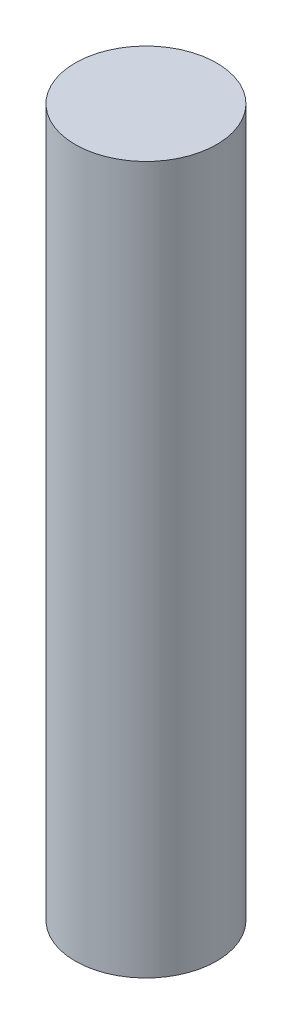
ISO-10303-21;
HEADER;
FILE_DESCRIPTION(('STEP AP214'),'2;1');
FILE_NAME('part.step','',(''),(''),'','','');
FILE_SCHEMA(('AUTOMOTIVE_DESIGN { 1 0 10303 214 1 1 1 1 }'));
ENDSEC;
DATA;
#1=APPLICATION_CONTEXT('core data for automotive mechanical design processes');
#2=APPLICATION_PROTOCOL_DEFINITION('international standard','automotive_design',2000,#1);
#3=PRODUCT_CONTEXT('',#1,'mechanical');
#4=PRODUCT('Part','Part','',(#3));
#5=PRODUCT_RELATED_PRODUCT_CATEGORY('part','',(#4));
#6=PRODUCT_DEFINITION_FORMATION('','',#4);
#7=PRODUCT_DEFINITION_CONTEXT('part definition',#1,'design');
#8=PRODUCT_DEFINITION('design','',#6,#7);
#9=PRODUCT_DEFINITION_SHAPE('','',#8);
#10=(LENGTH_UNIT() NAMED_UNIT(*) SI_UNIT(.MILLI.,.METRE.));
#11=(NAMED_UNIT(*) PLANE_ANGLE_UNIT() SI_UNIT($,.RADIAN.));
#12=(NAMED_UNIT(*) SI_UNIT($,.STERADIAN.) SOLID_ANGLE_UNIT());
#13=UNCERTAINTY_MEASURE_WITH_UNIT(LENGTH_MEASURE(1.E-05),#10,'distance_accuracy_value','');
#14=(GEOMETRIC_REPRESENTATION_CONTEXT(3) GLOBAL_UNCERTAINTY_ASSIGNED_CONTEXT((#13)) GLOBAL_UNIT_ASSIGNED_CONTEXT((#10,
#11,#12)) REPRESENTATION_CONTEXT('',''));
#15=CARTESIAN_POINT('',(0.,0.,0.));
#16=DIRECTION('',(0.,0.,1.));
#17=DIRECTION('',(1.,0.,0.));
#18=AXIS2_PLACEMENT_3D('',#15,#16,#17);
#19=CARTESIAN_POINT('',(0.,7.9375,0.));
#20=DIRECTION('',(0.,-1.,0.));
#21=DIRECTION('',(0.,0.,-1.));
#22=AXIS2_PLACEMENT_3D('',#19,#20,#21);
#23=CYLINDRICAL_SURFACE('',#22,0.793749999999999);
#24=CARTESIAN_POINT('',(0.,7.9375,0.));
#25=DIRECTION('',(0.,1.,0.));
#26=DIRECTION('',(0.,0.,1.));
#27=AXIS2_PLACEMENT_3D('',#24,#25,#26);
#28=CIRCLE('',#27,0.793749999999999);
#29=CARTESIAN_POINT('',(0.,7.9375,0.793749999999999));
#30=VERTEX_POINT('',#29);
#31=EDGE_CURVE('E10',#30,#30,#28,.T.);
#32=ORIENTED_EDGE('',*,*,#31,.F.);
#33=EDGE_LOOP('',(#32));
#34=FACE_BOUND('',#33,.T.);
#35=CARTESIAN_POINT('',(0.,0.,0.));
#36=DIRECTION('',(0.,1.,0.));
#37=DIRECTION('',(0.,0.,1.));
#38=AXIS2_PLACEMENT_3D('',#35,#36,#37);
#39=CIRCLE('',#38,0.793749999999999);
#40=CARTESIAN_POINT('',(0.,0.,0.793749999999999));
#41=VERTEX_POINT('',#40);
#42=EDGE_CURVE('E32',#41,#41,#39,.T.);
#43=ORIENTED_EDGE('',*,*,#42,.T.);
#44=EDGE_LOOP('',(#43));
#45=FACE_BOUND('',#44,.T.);
#46=ADVANCED_FACE('F29',(#34,#45),#23,.T.);
#47=CARTESIAN_POINT('',(0.,7.9375,0.));
#48=DIRECTION('',(0.,1.,0.));
#49=DIRECTION('',(0.,0.,1.));
#50=AXIS2_PLACEMENT_3D('',#47,#48,#49);
#51=PLANE('',#50);
#52=ORIENTED_EDGE('',*,*,#31,.T.);
#53=EDGE_LOOP('',(#52));
#54=FACE_BOUND('',#53,.T.);
#55=ADVANCED_FACE('F44',(#54),#51,.T.);
#56=CARTESIAN_POINT('',(0.,0.,0.));
#57=DIRECTION('',(0.,1.,0.));
#58=DIRECTION('',(0.,0.,1.));
#59=AXIS2_PLACEMENT_3D('',#56,#57,#58);
#60=PLANE('',#59);
#61=ORIENTED_EDGE('',*,*,#42,.F.);
#62=EDGE_LOOP('',(#61));
#63=FACE_BOUND('',#62,.T.);
#64=ADVANCED_FACE('F42',(#63),#60,.F.);
#65=CLOSED_SHELL('',(#46,#55,#64));
#66=MANIFOLD_SOLID_BREP('B2',#65);
#67=ADVANCED_BREP_SHAPE_REPRESENTATION('',(#18,#66),#14);
#68=SHAPE_DEFINITION_REPRESENTATION(#9,#67);
ENDSEC;
END-ISO-10303-21;
